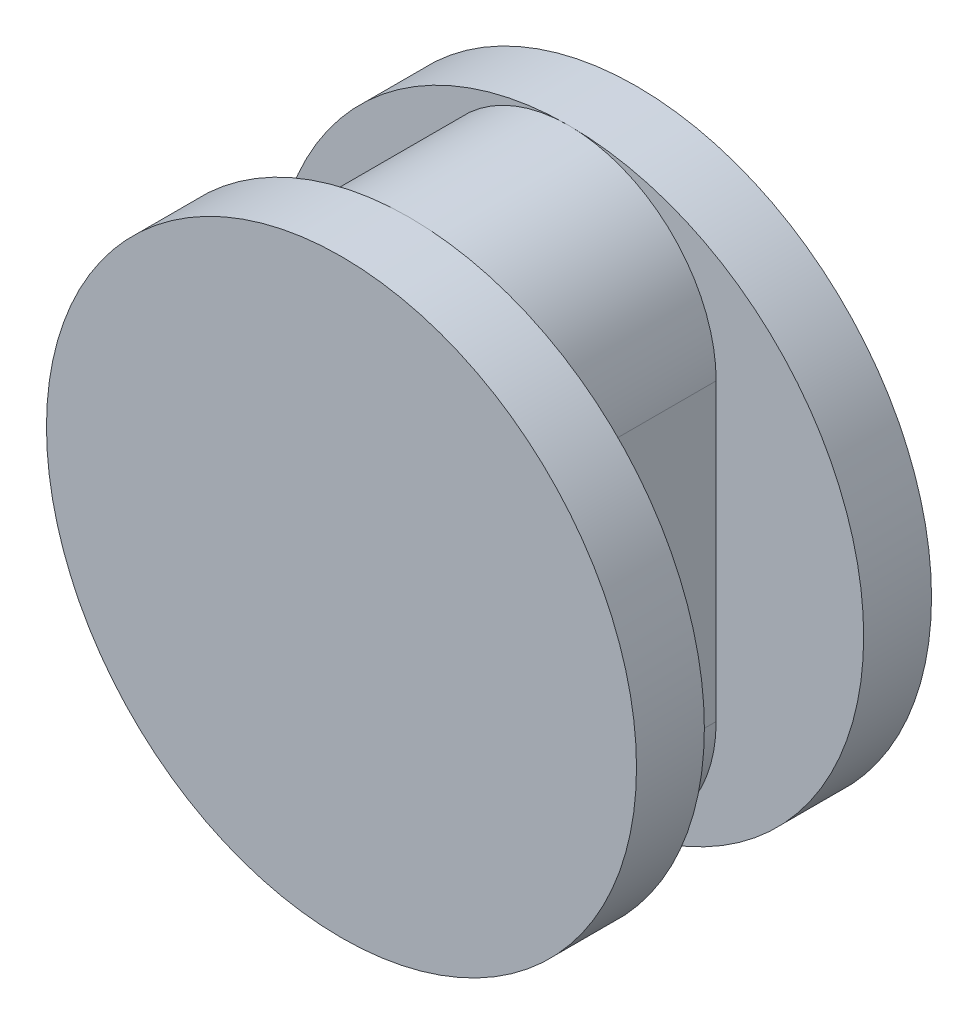
ISO-10303-21;
HEADER;
FILE_DESCRIPTION(('STEP AP214'),'2;1');
FILE_NAME('part.step','',(''),(''),'','','');
FILE_SCHEMA(('AUTOMOTIVE_DESIGN { 1 0 10303 214 1 1 1 1 }'));
ENDSEC;
DATA;
#1=APPLICATION_CONTEXT('core data for automotive mechanical design processes');
#2=APPLICATION_PROTOCOL_DEFINITION('international standard','automotive_design',2000,#1);
#3=PRODUCT_CONTEXT('',#1,'mechanical');
#4=PRODUCT('Part','Part','',(#3));
#5=PRODUCT_RELATED_PRODUCT_CATEGORY('part','',(#4));
#6=PRODUCT_DEFINITION_FORMATION('','',#4);
#7=PRODUCT_DEFINITION_CONTEXT('part definition',#1,'design');
#8=PRODUCT_DEFINITION('design','',#6,#7);
#9=PRODUCT_DEFINITION_SHAPE('','',#8);
#10=(LENGTH_UNIT() NAMED_UNIT(*) SI_UNIT(.MILLI.,.METRE.));
#11=(NAMED_UNIT(*) PLANE_ANGLE_UNIT() SI_UNIT($,.RADIAN.));
#12=(NAMED_UNIT(*) SI_UNIT($,.STERADIAN.) SOLID_ANGLE_UNIT());
#13=UNCERTAINTY_MEASURE_WITH_UNIT(LENGTH_MEASURE(1.E-05),#10,'distance_accuracy_value','');
#14=(GEOMETRIC_REPRESENTATION_CONTEXT(3) GLOBAL_UNCERTAINTY_ASSIGNED_CONTEXT((#13)) GLOBAL_UNIT_ASSIGNED_CONTEXT((#10,
#11,#12)) REPRESENTATION_CONTEXT('',''));
#15=CARTESIAN_POINT('',(0.,0.,0.));
#16=DIRECTION('',(0.,0.,1.));
#17=DIRECTION('',(1.,0.,0.));
#18=AXIS2_PLACEMENT_3D('',#15,#16,#17);
#19=CARTESIAN_POINT('',(0.,-10.,2.7));
#20=DIRECTION('',(0.,0.,-1.));
#21=DIRECTION('',(-1.,0.,0.));
#22=AXIS2_PLACEMENT_3D('',#19,#20,#21);
#23=CYLINDRICAL_SURFACE('',#22,5.);
#24=CARTESIAN_POINT('',(0.,-10.,-2.7));
#25=DIRECTION('',(0.,0.,1.));
#26=DIRECTION('',(1.,0.,0.));
#27=AXIS2_PLACEMENT_3D('',#24,#25,#26);
#28=CIRCLE('',#27,5.);
#29=CARTESIAN_POINT('',(-5.,-10.,-2.7));
#30=VERTEX_POINT('',#29);
#31=CARTESIAN_POINT('',(0.,-15.,-2.7));
#32=VERTEX_POINT('',#31);
#33=EDGE_CURVE('E145',#30,#32,#28,.T.);
#34=ORIENTED_EDGE('',*,*,#33,.T.);
#35=CARTESIAN_POINT('',(5.,-10.,-2.7));
#36=VERTEX_POINT('',#35);
#37=EDGE_CURVE('E114',#32,#36,#28,.T.);
#38=ORIENTED_EDGE('',*,*,#37,.T.);
#39=DIRECTION('',(0.,0.,-1.));
#40=VECTOR('',#39,1.);
#41=CARTESIAN_POINT('',(5.,-10.,2.7));
#42=LINE('',#41,#40);
#43=CARTESIAN_POINT('',(5.,-10.,2.7));
#44=VERTEX_POINT('',#43);
#45=EDGE_CURVE('E11',#44,#36,#42,.T.);
#46=ORIENTED_EDGE('',*,*,#45,.F.);
#47=CARTESIAN_POINT('',(0.,-10.,2.7));
#48=DIRECTION('',(0.,0.,1.));
#49=DIRECTION('',(1.,0.,0.));
#50=AXIS2_PLACEMENT_3D('',#47,#48,#49);
#51=CIRCLE('',#50,5.);
#52=CARTESIAN_POINT('',(0.,-15.,2.7));
#53=VERTEX_POINT('',#52);
#54=EDGE_CURVE('E60',#53,#44,#51,.T.);
#55=ORIENTED_EDGE('',*,*,#54,.F.);
#56=CARTESIAN_POINT('',(-5.,-10.,2.7));
#57=VERTEX_POINT('',#56);
#58=EDGE_CURVE('E142',#57,#53,#51,.T.);
#59=ORIENTED_EDGE('',*,*,#58,.F.);
#60=DIRECTION('',(0.,0.,-1.));
#61=VECTOR('',#60,1.);
#62=CARTESIAN_POINT('',(-5.,-10.,2.7));
#63=LINE('',#62,#61);
#64=EDGE_CURVE('E122',#57,#30,#63,.T.);
#65=ORIENTED_EDGE('',*,*,#64,.T.);
#66=EDGE_LOOP('',(#34,#38,#46,#55,#59,#65));
#67=FACE_BOUND('',#66,.T.);
#68=ADVANCED_FACE('F38',(#67),#23,.T.);
#69=CARTESIAN_POINT('',(5.,-10.,2.7));
#70=DIRECTION('',(-1.,0.,0.));
#71=DIRECTION('',(0.,-1.,0.));
#72=AXIS2_PLACEMENT_3D('',#69,#70,#71);
#73=PLANE('',#72);
#74=DIRECTION('',(0.,1.,0.));
#75=VECTOR('',#74,1.);
#76=CARTESIAN_POINT('',(5.,-10.,-2.7));
#77=LINE('',#76,#75);
#78=CARTESIAN_POINT('',(5.,0.,-2.7));
#79=VERTEX_POINT('',#78);
#80=EDGE_CURVE('E102',#36,#79,#77,.T.);
#81=ORIENTED_EDGE('',*,*,#80,.T.);
#82=DIRECTION('',(0.,0.,-1.));
#83=VECTOR('',#82,1.);
#84=CARTESIAN_POINT('',(5.,0.,2.7));
#85=LINE('',#84,#83);
#86=CARTESIAN_POINT('',(5.,0.,2.7));
#87=VERTEX_POINT('',#86);
#88=EDGE_CURVE('E45',#87,#79,#85,.T.);
#89=ORIENTED_EDGE('',*,*,#88,.F.);
#90=DIRECTION('',(0.,1.,0.));
#91=VECTOR('',#90,1.);
#92=CARTESIAN_POINT('',(5.,-10.,2.7));
#93=LINE('',#92,#91);
#94=EDGE_CURVE('E139',#44,#87,#93,.T.);
#95=ORIENTED_EDGE('',*,*,#94,.F.);
#96=ORIENTED_EDGE('',*,*,#45,.T.);
#97=EDGE_LOOP('',(#81,#89,#95,#96));
#98=FACE_BOUND('',#97,.T.);
#99=ADVANCED_FACE('F172',(#98),#73,.F.);
#100=CARTESIAN_POINT('',(0.,0.,2.7));
#101=DIRECTION('',(0.,0.,-1.));
#102=DIRECTION('',(-1.,0.,0.));
#103=AXIS2_PLACEMENT_3D('',#100,#101,#102);
#104=CYLINDRICAL_SURFACE('',#103,5.);
#105=CARTESIAN_POINT('',(0.,0.,-2.7));
#106=DIRECTION('',(0.,0.,1.));
#107=DIRECTION('',(1.,0.,0.));
#108=AXIS2_PLACEMENT_3D('',#105,#106,#107);
#109=CIRCLE('',#108,5.);
#110=CARTESIAN_POINT('',(0.,5.,-2.7));
#111=VERTEX_POINT('',#110);
#112=EDGE_CURVE('E101',#79,#111,#109,.T.);
#113=ORIENTED_EDGE('',*,*,#112,.T.);
#114=CARTESIAN_POINT('',(-5.,0.,-2.7));
#115=VERTEX_POINT('',#114);
#116=EDGE_CURVE('E92',#111,#115,#109,.T.);
#117=ORIENTED_EDGE('',*,*,#116,.T.);
#118=DIRECTION('',(0.,0.,-1.));
#119=VECTOR('',#118,1.);
#120=CARTESIAN_POINT('',(-5.,0.,2.7));
#121=LINE('',#120,#119);
#122=CARTESIAN_POINT('',(-5.,0.,2.7));
#123=VERTEX_POINT('',#122);
#124=EDGE_CURVE('E125',#123,#115,#121,.T.);
#125=ORIENTED_EDGE('',*,*,#124,.F.);
#126=CARTESIAN_POINT('',(0.,0.,2.7));
#127=DIRECTION('',(0.,0.,1.));
#128=DIRECTION('',(1.,0.,0.));
#129=AXIS2_PLACEMENT_3D('',#126,#127,#128);
#130=CIRCLE('',#129,5.);
#131=CARTESIAN_POINT('',(0.,5.,2.7));
#132=VERTEX_POINT('',#131);
#133=EDGE_CURVE('E52',#132,#123,#130,.T.);
#134=ORIENTED_EDGE('',*,*,#133,.F.);
#135=EDGE_CURVE('E133',#87,#132,#130,.T.);
#136=ORIENTED_EDGE('',*,*,#135,.F.);
#137=ORIENTED_EDGE('',*,*,#88,.T.);
#138=EDGE_LOOP('',(#113,#117,#125,#134,#136,#137));
#139=FACE_BOUND('',#138,.T.);
#140=ADVANCED_FACE('F117',(#139),#104,.T.);
#141=CARTESIAN_POINT('',(-5.,0.,2.7));
#142=DIRECTION('',(1.,0.,0.));
#143=DIRECTION('',(0.,1.,0.));
#144=AXIS2_PLACEMENT_3D('',#141,#142,#143);
#145=PLANE('',#144);
#146=DIRECTION('',(0.,-1.,0.));
#147=VECTOR('',#146,1.);
#148=CARTESIAN_POINT('',(-5.,0.,-2.7));
#149=LINE('',#148,#147);
#150=EDGE_CURVE('E98',#115,#30,#149,.T.);
#151=ORIENTED_EDGE('',*,*,#150,.T.);
#152=ORIENTED_EDGE('',*,*,#64,.F.);
#153=DIRECTION('',(0.,-1.,0.));
#154=VECTOR('',#153,1.);
#155=CARTESIAN_POINT('',(-5.,0.,2.7));
#156=LINE('',#155,#154);
#157=EDGE_CURVE('E126',#123,#57,#156,.T.);
#158=ORIENTED_EDGE('',*,*,#157,.F.);
#159=ORIENTED_EDGE('',*,*,#124,.T.);
#160=EDGE_LOOP('',(#151,#152,#158,#159));
#161=FACE_BOUND('',#160,.T.);
#162=ADVANCED_FACE('F129',(#161),#145,.F.);
#163=CARTESIAN_POINT('',(0.,-5.,2.7));
#164=DIRECTION('',(0.,0.,1.));
#165=DIRECTION('',(1.,0.,0.));
#166=AXIS2_PLACEMENT_3D('',#163,#164,#165);
#167=PLANE('',#166);
#168=ORIENTED_EDGE('',*,*,#157,.T.);
#169=ORIENTED_EDGE('',*,*,#58,.T.);
#170=CARTESIAN_POINT('',(0.,-5.,2.7));
#171=DIRECTION('',(0.,0.,1.));
#172=DIRECTION('',(1.,0.,0.));
#173=AXIS2_PLACEMENT_3D('',#170,#171,#172);
#174=CIRCLE('',#173,10.);
#175=EDGE_CURVE('E138',#132,#53,#174,.T.);
#176=ORIENTED_EDGE('',*,*,#175,.F.);
#177=ORIENTED_EDGE('',*,*,#133,.T.);
#178=EDGE_LOOP('',(#168,#169,#176,#177));
#179=FACE_BOUND('',#178,.T.);
#180=ADVANCED_FACE('F136',(#179),#167,.F.);
#181=CARTESIAN_POINT('',(0.,-5.,5.));
#182=DIRECTION('',(0.,0.,-1.));
#183=DIRECTION('',(-1.,0.,0.));
#184=AXIS2_PLACEMENT_3D('',#181,#182,#183);
#185=CYLINDRICAL_SURFACE('',#184,10.);
#186=CARTESIAN_POINT('',(0.,-5.,5.));
#187=DIRECTION('',(0.,0.,1.));
#188=DIRECTION('',(1.,0.,0.));
#189=AXIS2_PLACEMENT_3D('',#186,#187,#188);
#190=CIRCLE('',#189,10.);
#191=CARTESIAN_POINT('',(10.,-5.,5.));
#192=VERTEX_POINT('',#191);
#193=EDGE_CURVE('E146',#192,#192,#190,.T.);
#194=ORIENTED_EDGE('',*,*,#193,.F.);
#195=EDGE_LOOP('',(#194));
#196=FACE_BOUND('',#195,.T.);
#197=ORIENTED_EDGE('',*,*,#175,.T.);
#198=EDGE_CURVE('E151',#53,#132,#174,.T.);
#199=ORIENTED_EDGE('',*,*,#198,.T.);
#200=EDGE_LOOP('',(#197,#199));
#201=FACE_BOUND('',#200,.T.);
#202=ADVANCED_FACE('F159',(#196,#201),#185,.T.);
#203=CARTESIAN_POINT('',(0.,-5.,5.));
#204=DIRECTION('',(0.,0.,1.));
#205=DIRECTION('',(1.,0.,0.));
#206=AXIS2_PLACEMENT_3D('',#203,#204,#205);
#207=PLANE('',#206);
#208=ORIENTED_EDGE('',*,*,#193,.T.);
#209=EDGE_LOOP('',(#208));
#210=FACE_BOUND('',#209,.T.);
#211=ADVANCED_FACE('F161',(#210),#207,.T.);
#212=ORIENTED_EDGE('',*,*,#198,.F.);
#213=ORIENTED_EDGE('',*,*,#54,.T.);
#214=ORIENTED_EDGE('',*,*,#94,.T.);
#215=ORIENTED_EDGE('',*,*,#135,.T.);
#216=EDGE_LOOP('',(#212,#213,#214,#215));
#217=FACE_BOUND('',#216,.T.);
#218=ADVANCED_FACE('F156',(#217),#167,.F.);
#219=CARTESIAN_POINT('',(0.,0.,-2.7));
#220=DIRECTION('',(0.,0.,-1.));
#221=DIRECTION('',(-1.,0.,0.));
#222=AXIS2_PLACEMENT_3D('',#219,#220,#221);
#223=PLANE('',#222);
#224=ORIENTED_EDGE('',*,*,#150,.F.);
#225=ORIENTED_EDGE('',*,*,#116,.F.);
#226=CARTESIAN_POINT('',(0.,-5.,-2.7));
#227=DIRECTION('',(0.,0.,-1.));
#228=DIRECTION('',(-1.,0.,0.));
#229=AXIS2_PLACEMENT_3D('',#226,#227,#228);
#230=CIRCLE('',#229,10.);
#231=EDGE_CURVE('E95',#32,#111,#230,.T.);
#232=ORIENTED_EDGE('',*,*,#231,.F.);
#233=ORIENTED_EDGE('',*,*,#33,.F.);
#234=EDGE_LOOP('',(#224,#225,#232,#233));
#235=FACE_BOUND('',#234,.T.);
#236=ADVANCED_FACE('F94',(#235),#223,.F.);
#237=ORIENTED_EDGE('',*,*,#37,.F.);
#238=EDGE_CURVE('E107',#111,#32,#230,.T.);
#239=ORIENTED_EDGE('',*,*,#238,.F.);
#240=ORIENTED_EDGE('',*,*,#112,.F.);
#241=ORIENTED_EDGE('',*,*,#80,.F.);
#242=EDGE_LOOP('',(#237,#239,#240,#241));
#243=FACE_BOUND('',#242,.T.);
#244=ADVANCED_FACE('F111',(#243),#223,.F.);
#245=CARTESIAN_POINT('',(0.,-5.,-5.));
#246=DIRECTION('',(0.,0.,1.));
#247=DIRECTION('',(1.,0.,0.));
#248=AXIS2_PLACEMENT_3D('',#245,#246,#247);
#249=CYLINDRICAL_SURFACE('',#248,10.);
#250=CARTESIAN_POINT('',(0.,-5.,-5.));
#251=DIRECTION('',(0.,0.,-1.));
#252=DIRECTION('',(-1.,0.,0.));
#253=AXIS2_PLACEMENT_3D('',#250,#251,#252);
#254=CIRCLE('',#253,10.);
#255=CARTESIAN_POINT('',(-10.,-5.,-5.));
#256=VERTEX_POINT('',#255);
#257=EDGE_CURVE('E115',#256,#256,#254,.T.);
#258=ORIENTED_EDGE('',*,*,#257,.F.);
#259=EDGE_LOOP('',(#258));
#260=FACE_BOUND('',#259,.T.);
#261=ORIENTED_EDGE('',*,*,#238,.T.);
#262=ORIENTED_EDGE('',*,*,#231,.T.);
#263=EDGE_LOOP('',(#261,#262));
#264=FACE_BOUND('',#263,.T.);
#265=ADVANCED_FACE('F106',(#260,#264),#249,.T.);
#266=CARTESIAN_POINT('',(0.,0.,-5.));
#267=DIRECTION('',(0.,0.,-1.));
#268=DIRECTION('',(-1.,0.,0.));
#269=AXIS2_PLACEMENT_3D('',#266,#267,#268);
#270=PLANE('',#269);
#271=ORIENTED_EDGE('',*,*,#257,.T.);
#272=EDGE_LOOP('',(#271));
#273=FACE_BOUND('',#272,.T.);
#274=ADVANCED_FACE('F243',(#273),#270,.T.);
#275=CLOSED_SHELL('',(#68,#99,#140,#162,#180,#202,#211,#218,#236,#244,#265,#274));
#276=MANIFOLD_SOLID_BREP('B2',#275);
#277=ADVANCED_BREP_SHAPE_REPRESENTATION('',(#18,#276),#14);
#278=SHAPE_DEFINITION_REPRESENTATION(#9,#277);
ENDSEC;
END-ISO-10303-21;
